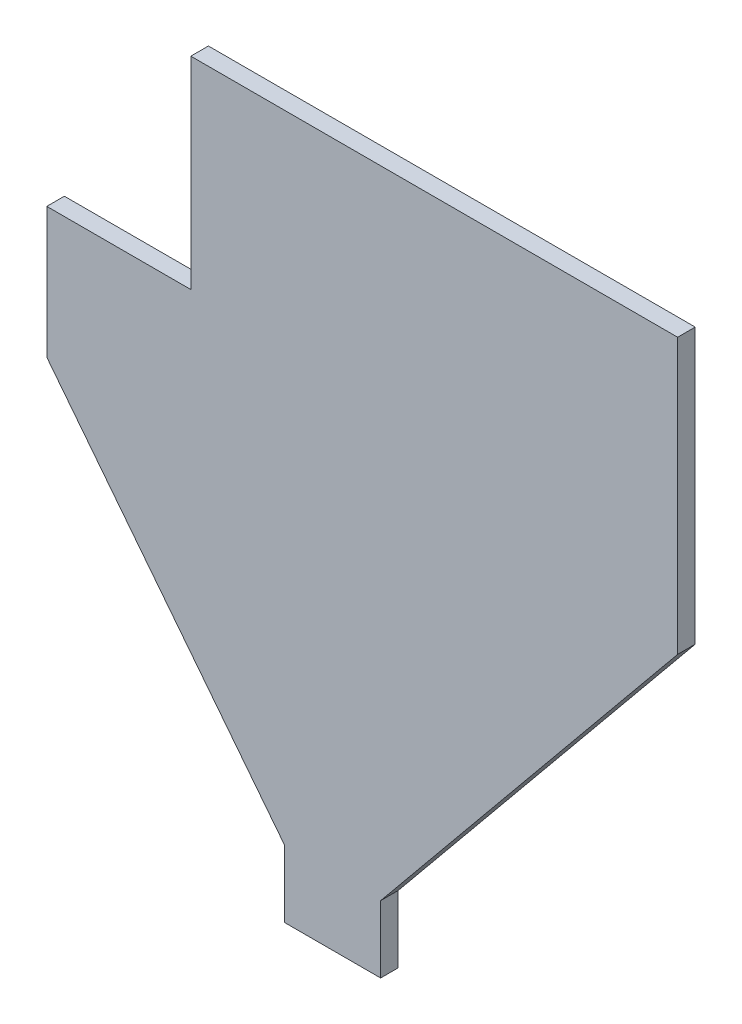
ISO-10303-21;
HEADER;
FILE_DESCRIPTION(('STEP AP214'),'2;1');
FILE_NAME('part.step','',(''),(''),'','','');
FILE_SCHEMA(('AUTOMOTIVE_DESIGN { 1 0 10303 214 1 1 1 1 }'));
ENDSEC;
DATA;
#1=APPLICATION_CONTEXT('core data for automotive mechanical design processes');
#2=APPLICATION_PROTOCOL_DEFINITION('international standard','automotive_design',2000,#1);
#3=PRODUCT_CONTEXT('',#1,'mechanical');
#4=PRODUCT('Part','Part','',(#3));
#5=PRODUCT_RELATED_PRODUCT_CATEGORY('part','',(#4));
#6=PRODUCT_DEFINITION_FORMATION('','',#4);
#7=PRODUCT_DEFINITION_CONTEXT('part definition',#1,'design');
#8=PRODUCT_DEFINITION('design','',#6,#7);
#9=PRODUCT_DEFINITION_SHAPE('','',#8);
#10=(LENGTH_UNIT() NAMED_UNIT(*) SI_UNIT(.MILLI.,.METRE.));
#11=(NAMED_UNIT(*) PLANE_ANGLE_UNIT() SI_UNIT($,.RADIAN.));
#12=(NAMED_UNIT(*) SI_UNIT($,.STERADIAN.) SOLID_ANGLE_UNIT());
#13=UNCERTAINTY_MEASURE_WITH_UNIT(LENGTH_MEASURE(1.E-05),#10,'distance_accuracy_value','');
#14=(GEOMETRIC_REPRESENTATION_CONTEXT(3) GLOBAL_UNCERTAINTY_ASSIGNED_CONTEXT((#13)) GLOBAL_UNIT_ASSIGNED_CONTEXT((#10,
#11,#12)) REPRESENTATION_CONTEXT('',''));
#15=CARTESIAN_POINT('',(0.,0.,0.));
#16=DIRECTION('',(0.,0.,1.));
#17=DIRECTION('',(1.,0.,0.));
#18=AXIS2_PLACEMENT_3D('',#15,#16,#17);
#19=CARTESIAN_POINT('',(39.243,-1.27,2.));
#20=DIRECTION('',(0.,-1.,0.));
#21=DIRECTION('',(1.,0.,0.));
#22=AXIS2_PLACEMENT_3D('',#19,#20,#21);
#23=PLANE('',#22);
#24=DIRECTION('',(-1.,0.,0.));
#25=VECTOR('',#24,1.);
#26=CARTESIAN_POINT('',(39.243,-1.27,0.));
#27=LINE('',#26,#25);
#28=CARTESIAN_POINT('',(39.243,-1.27,0.));
#29=VERTEX_POINT('',#28);
#30=CARTESIAN_POINT('',(-16.129,-1.27,0.));
#31=VERTEX_POINT('',#30);
#32=EDGE_CURVE('E141',#29,#31,#27,.T.);
#33=ORIENTED_EDGE('',*,*,#32,.T.);
#34=DIRECTION('',(0.,0.,-1.));
#35=VECTOR('',#34,1.);
#36=CARTESIAN_POINT('',(-16.129,-1.27,2.));
#37=LINE('',#36,#35);
#38=CARTESIAN_POINT('',(-16.129,-1.27,2.));
#39=VERTEX_POINT('',#38);
#40=EDGE_CURVE('E11',#39,#31,#37,.T.);
#41=ORIENTED_EDGE('',*,*,#40,.F.);
#42=DIRECTION('',(-1.,0.,0.));
#43=VECTOR('',#42,1.);
#44=CARTESIAN_POINT('',(39.243,-1.27,2.));
#45=LINE('',#44,#43);
#46=CARTESIAN_POINT('',(39.243,-1.27,2.));
#47=VERTEX_POINT('',#46);
#48=EDGE_CURVE('E159',#47,#39,#45,.T.);
#49=ORIENTED_EDGE('',*,*,#48,.F.);
#50=DIRECTION('',(0.,0.,-1.));
#51=VECTOR('',#50,1.);
#52=CARTESIAN_POINT('',(39.243,-1.27,2.));
#53=LINE('',#52,#51);
#54=EDGE_CURVE('E137',#47,#29,#53,.T.);
#55=ORIENTED_EDGE('',*,*,#54,.T.);
#56=EDGE_LOOP('',(#33,#41,#49,#55));
#57=FACE_BOUND('',#56,.T.);
#58=ADVANCED_FACE('F33',(#57),#23,.F.);
#59=CARTESIAN_POINT('',(-16.129,-1.27,2.));
#60=DIRECTION('',(1.,0.,0.));
#61=DIRECTION('',(0.,1.,0.));
#62=AXIS2_PLACEMENT_3D('',#59,#60,#61);
#63=PLANE('',#62);
#64=DIRECTION('',(0.,-1.,0.));
#65=VECTOR('',#64,1.);
#66=CARTESIAN_POINT('',(-16.129,-1.27,0.));
#67=LINE('',#66,#65);
#68=CARTESIAN_POINT('',(-16.129,-24.257,0.));
#69=VERTEX_POINT('',#68);
#70=EDGE_CURVE('E144',#31,#69,#67,.T.);
#71=ORIENTED_EDGE('',*,*,#70,.T.);
#72=DIRECTION('',(0.,0.,-1.));
#73=VECTOR('',#72,1.);
#74=CARTESIAN_POINT('',(-16.129,-24.257,2.));
#75=LINE('',#74,#73);
#76=CARTESIAN_POINT('',(-16.129,-24.257,2.));
#77=VERTEX_POINT('',#76);
#78=EDGE_CURVE('E41',#77,#69,#75,.T.);
#79=ORIENTED_EDGE('',*,*,#78,.F.);
#80=DIRECTION('',(0.,-1.,0.));
#81=VECTOR('',#80,1.);
#82=CARTESIAN_POINT('',(-16.129,-1.27,2.));
#83=LINE('',#82,#81);
#84=EDGE_CURVE('E98',#39,#77,#83,.T.);
#85=ORIENTED_EDGE('',*,*,#84,.F.);
#86=ORIENTED_EDGE('',*,*,#40,.T.);
#87=EDGE_LOOP('',(#71,#79,#85,#86));
#88=FACE_BOUND('',#87,.T.);
#89=ADVANCED_FACE('F208',(#88),#63,.F.);
#90=CARTESIAN_POINT('',(-16.129,-24.257,2.));
#91=DIRECTION('',(0.,-1.,0.));
#92=DIRECTION('',(1.,0.,0.));
#93=AXIS2_PLACEMENT_3D('',#90,#91,#92);
#94=PLANE('',#93);
#95=DIRECTION('',(-1.,0.,0.));
#96=VECTOR('',#95,1.);
#97=CARTESIAN_POINT('',(-16.129,-24.257,0.));
#98=LINE('',#97,#96);
#99=CARTESIAN_POINT('',(-32.512,-24.257,0.));
#100=VERTEX_POINT('',#99);
#101=EDGE_CURVE('E146',#69,#100,#98,.T.);
#102=ORIENTED_EDGE('',*,*,#101,.T.);
#103=DIRECTION('',(0.,0.,-1.));
#104=VECTOR('',#103,1.);
#105=CARTESIAN_POINT('',(-32.512,-24.257,2.));
#106=LINE('',#105,#104);
#107=CARTESIAN_POINT('',(-32.512,-24.257,2.));
#108=VERTEX_POINT('',#107);
#109=EDGE_CURVE('E172',#108,#100,#106,.T.);
#110=ORIENTED_EDGE('',*,*,#109,.F.);
#111=DIRECTION('',(-1.,0.,0.));
#112=VECTOR('',#111,1.);
#113=CARTESIAN_POINT('',(-16.129,-24.257,2.));
#114=LINE('',#113,#112);
#115=EDGE_CURVE('E180',#77,#108,#114,.T.);
#116=ORIENTED_EDGE('',*,*,#115,.F.);
#117=ORIENTED_EDGE('',*,*,#78,.T.);
#118=EDGE_LOOP('',(#102,#110,#116,#117));
#119=FACE_BOUND('',#118,.T.);
#120=ADVANCED_FACE('F178',(#119),#94,.F.);
#121=CARTESIAN_POINT('',(-32.512,-24.257,2.));
#122=DIRECTION('',(1.,0.,0.));
#123=DIRECTION('',(0.,1.,0.));
#124=AXIS2_PLACEMENT_3D('',#121,#122,#123);
#125=PLANE('',#124);
#126=DIRECTION('',(0.,-1.,0.));
#127=VECTOR('',#126,1.);
#128=CARTESIAN_POINT('',(-32.512,-24.257,0.));
#129=LINE('',#128,#127);
#130=CARTESIAN_POINT('',(-32.512,-39.116,0.));
#131=VERTEX_POINT('',#130);
#132=EDGE_CURVE('E148',#100,#131,#129,.T.);
#133=ORIENTED_EDGE('',*,*,#132,.T.);
#134=DIRECTION('',(0.,0.,-1.));
#135=VECTOR('',#134,1.);
#136=CARTESIAN_POINT('',(-32.512,-39.116,2.));
#137=LINE('',#136,#135);
#138=CARTESIAN_POINT('',(-32.512,-39.116,2.));
#139=VERTEX_POINT('',#138);
#140=EDGE_CURVE('E169',#139,#131,#137,.T.);
#141=ORIENTED_EDGE('',*,*,#140,.F.);
#142=DIRECTION('',(0.,-1.,0.));
#143=VECTOR('',#142,1.);
#144=CARTESIAN_POINT('',(-32.512,-24.257,2.));
#145=LINE('',#144,#143);
#146=EDGE_CURVE('E198',#108,#139,#145,.T.);
#147=ORIENTED_EDGE('',*,*,#146,.F.);
#148=ORIENTED_EDGE('',*,*,#109,.T.);
#149=EDGE_LOOP('',(#133,#141,#147,#148));
#150=FACE_BOUND('',#149,.T.);
#151=ADVANCED_FACE('F189',(#150),#125,.F.);
#152=CARTESIAN_POINT('',(-32.512,-39.116,2.));
#153=DIRECTION('',(0.787321722918435,0.616542378608922,0.));
#154=DIRECTION('',(-0.616542378608922,0.787321722918435,0.));
#155=AXIS2_PLACEMENT_3D('',#152,#153,#154);
#156=PLANE('',#155);
#157=DIRECTION('',(0.616542378608921,-0.787321722918435,0.));
#158=VECTOR('',#157,1.);
#159=CARTESIAN_POINT('',(-32.512,-39.116,0.));
#160=LINE('',#159,#158);
#161=CARTESIAN_POINT('',(-5.461,-73.66,0.));
#162=VERTEX_POINT('',#161);
#163=EDGE_CURVE('E150',#131,#162,#160,.T.);
#164=ORIENTED_EDGE('',*,*,#163,.T.);
#165=DIRECTION('',(0.,0.,-1.));
#166=VECTOR('',#165,1.);
#167=CARTESIAN_POINT('',(-5.461,-73.66,2.));
#168=LINE('',#167,#166);
#169=CARTESIAN_POINT('',(-5.461,-73.66,2.));
#170=VERTEX_POINT('',#169);
#171=EDGE_CURVE('E166',#170,#162,#168,.T.);
#172=ORIENTED_EDGE('',*,*,#171,.F.);
#173=DIRECTION('',(0.616542378608921,-0.787321722918435,0.));
#174=VECTOR('',#173,1.);
#175=CARTESIAN_POINT('',(-32.512,-39.116,2.));
#176=LINE('',#175,#174);
#177=EDGE_CURVE('E195',#139,#170,#176,.T.);
#178=ORIENTED_EDGE('',*,*,#177,.F.);
#179=ORIENTED_EDGE('',*,*,#140,.T.);
#180=EDGE_LOOP('',(#164,#172,#178,#179));
#181=FACE_BOUND('',#180,.T.);
#182=ADVANCED_FACE('F193',(#181),#156,.F.);
#183=CARTESIAN_POINT('',(-5.461,-73.66,2.));
#184=DIRECTION('',(1.,0.,0.));
#185=DIRECTION('',(0.,1.,0.));
#186=AXIS2_PLACEMENT_3D('',#183,#184,#185);
#187=PLANE('',#186);
#188=DIRECTION('',(0.,-1.,0.));
#189=VECTOR('',#188,1.);
#190=CARTESIAN_POINT('',(-5.461,-73.66,0.));
#191=LINE('',#190,#189);
#192=CARTESIAN_POINT('',(-5.46099999999999,-81.28,0.));
#193=VERTEX_POINT('',#192);
#194=EDGE_CURVE('E152',#162,#193,#191,.T.);
#195=ORIENTED_EDGE('',*,*,#194,.T.);
#196=DIRECTION('',(0.,0.,-1.));
#197=VECTOR('',#196,1.);
#198=CARTESIAN_POINT('',(-5.46099999999999,-81.28,2.));
#199=LINE('',#198,#197);
#200=CARTESIAN_POINT('',(-5.46099999999999,-81.28,2.));
#201=VERTEX_POINT('',#200);
#202=EDGE_CURVE('E163',#201,#193,#199,.T.);
#203=ORIENTED_EDGE('',*,*,#202,.F.);
#204=DIRECTION('',(0.,-1.,0.));
#205=VECTOR('',#204,1.);
#206=CARTESIAN_POINT('',(-5.461,-73.66,2.));
#207=LINE('',#206,#205);
#208=EDGE_CURVE('E197',#170,#201,#207,.T.);
#209=ORIENTED_EDGE('',*,*,#208,.F.);
#210=ORIENTED_EDGE('',*,*,#171,.T.);
#211=EDGE_LOOP('',(#195,#203,#209,#210));
#212=FACE_BOUND('',#211,.T.);
#213=ADVANCED_FACE('F220',(#212),#187,.F.);
#214=CARTESIAN_POINT('',(-5.46099999999999,-81.28,2.));
#215=DIRECTION('',(0.,1.,0.));
#216=DIRECTION('',(0.,0.,1.));
#217=AXIS2_PLACEMENT_3D('',#214,#215,#216);
#218=PLANE('',#217);
#219=DIRECTION('',(1.,0.,0.));
#220=VECTOR('',#219,1.);
#221=CARTESIAN_POINT('',(-5.46099999999999,-81.28,0.));
#222=LINE('',#221,#220);
#223=CARTESIAN_POINT('',(5.46100000000001,-81.28,0.));
#224=VERTEX_POINT('',#223);
#225=EDGE_CURVE('E154',#193,#224,#222,.T.);
#226=ORIENTED_EDGE('',*,*,#225,.T.);
#227=DIRECTION('',(0.,0.,-1.));
#228=VECTOR('',#227,1.);
#229=CARTESIAN_POINT('',(5.46100000000001,-81.28,2.));
#230=LINE('',#229,#228);
#231=CARTESIAN_POINT('',(5.46100000000001,-81.28,2.));
#232=VERTEX_POINT('',#231);
#233=EDGE_CURVE('E132',#232,#224,#230,.T.);
#234=ORIENTED_EDGE('',*,*,#233,.F.);
#235=DIRECTION('',(1.,0.,0.));
#236=VECTOR('',#235,1.);
#237=CARTESIAN_POINT('',(-5.46099999999999,-81.28,2.));
#238=LINE('',#237,#236);
#239=EDGE_CURVE('E123',#201,#232,#238,.T.);
#240=ORIENTED_EDGE('',*,*,#239,.F.);
#241=ORIENTED_EDGE('',*,*,#202,.T.);
#242=EDGE_LOOP('',(#226,#234,#240,#241));
#243=FACE_BOUND('',#242,.T.);
#244=ADVANCED_FACE('F223',(#243),#218,.F.);
#245=CARTESIAN_POINT('',(5.46100000000001,-81.28,2.));
#246=DIRECTION('',(-1.,0.,0.));
#247=DIRECTION('',(0.,-1.,0.));
#248=AXIS2_PLACEMENT_3D('',#245,#246,#247);
#249=PLANE('',#248);
#250=DIRECTION('',(0.,1.,0.));
#251=VECTOR('',#250,1.);
#252=CARTESIAN_POINT('',(5.46100000000001,-81.28,0.));
#253=LINE('',#252,#251);
#254=CARTESIAN_POINT('',(5.461,-73.66,0.));
#255=VERTEX_POINT('',#254);
#256=EDGE_CURVE('E131',#224,#255,#253,.T.);
#257=ORIENTED_EDGE('',*,*,#256,.T.);
#258=DIRECTION('',(0.,0.,-1.));
#259=VECTOR('',#258,1.);
#260=CARTESIAN_POINT('',(5.461,-73.66,2.));
#261=LINE('',#260,#259);
#262=CARTESIAN_POINT('',(5.461,-73.66,2.));
#263=VERTEX_POINT('',#262);
#264=EDGE_CURVE('E128',#263,#255,#261,.T.);
#265=ORIENTED_EDGE('',*,*,#264,.F.);
#266=DIRECTION('',(0.,1.,0.));
#267=VECTOR('',#266,1.);
#268=CARTESIAN_POINT('',(5.46100000000001,-81.28,2.));
#269=LINE('',#268,#267);
#270=EDGE_CURVE('E117',#232,#263,#269,.T.);
#271=ORIENTED_EDGE('',*,*,#270,.F.);
#272=ORIENTED_EDGE('',*,*,#233,.T.);
#273=EDGE_LOOP('',(#257,#265,#271,#272));
#274=FACE_BOUND('',#273,.T.);
#275=ADVANCED_FACE('F129',(#274),#249,.F.);
#276=CARTESIAN_POINT('',(5.461,-73.66,2.));
#277=DIRECTION('',(-0.772893374383013,0.634535918474943,0.));
#278=DIRECTION('',(-0.634535918474943,-0.772893374383013,0.));
#279=AXIS2_PLACEMENT_3D('',#276,#277,#278);
#280=PLANE('',#279);
#281=DIRECTION('',(0.634535918474943,0.772893374383013,0.));
#282=VECTOR('',#281,1.);
#283=CARTESIAN_POINT('',(5.461,-73.66,0.));
#284=LINE('',#283,#282);
#285=CARTESIAN_POINT('',(39.243,-32.512,0.));
#286=VERTEX_POINT('',#285);
#287=EDGE_CURVE('E84',#255,#286,#284,.T.);
#288=ORIENTED_EDGE('',*,*,#287,.T.);
#289=DIRECTION('',(0.,0.,-1.));
#290=VECTOR('',#289,1.);
#291=CARTESIAN_POINT('',(39.243,-32.512,2.));
#292=LINE('',#291,#290);
#293=CARTESIAN_POINT('',(39.243,-32.512,2.));
#294=VERTEX_POINT('',#293);
#295=EDGE_CURVE('E133',#294,#286,#292,.T.);
#296=ORIENTED_EDGE('',*,*,#295,.F.);
#297=DIRECTION('',(0.634535918474943,0.772893374383013,0.));
#298=VECTOR('',#297,1.);
#299=CARTESIAN_POINT('',(5.461,-73.66,2.));
#300=LINE('',#299,#298);
#301=EDGE_CURVE('E121',#263,#294,#300,.T.);
#302=ORIENTED_EDGE('',*,*,#301,.F.);
#303=ORIENTED_EDGE('',*,*,#264,.T.);
#304=EDGE_LOOP('',(#288,#296,#302,#303));
#305=FACE_BOUND('',#304,.T.);
#306=ADVANCED_FACE('F135',(#305),#280,.F.);
#307=CARTESIAN_POINT('',(39.243,-32.512,2.));
#308=DIRECTION('',(-1.,0.,0.));
#309=DIRECTION('',(0.,0.,1.));
#310=AXIS2_PLACEMENT_3D('',#307,#308,#309);
#311=PLANE('',#310);
#312=DIRECTION('',(0.,1.,0.));
#313=VECTOR('',#312,1.);
#314=CARTESIAN_POINT('',(39.243,-32.512,0.));
#315=LINE('',#314,#313);
#316=EDGE_CURVE('E90',#286,#29,#315,.T.);
#317=ORIENTED_EDGE('',*,*,#316,.T.);
#318=ORIENTED_EDGE('',*,*,#54,.F.);
#319=DIRECTION('',(0.,1.,0.));
#320=VECTOR('',#319,1.);
#321=CARTESIAN_POINT('',(39.243,-32.512,2.));
#322=LINE('',#321,#320);
#323=EDGE_CURVE('E49',#294,#47,#322,.T.);
#324=ORIENTED_EDGE('',*,*,#323,.F.);
#325=ORIENTED_EDGE('',*,*,#295,.T.);
#326=EDGE_LOOP('',(#317,#318,#324,#325));
#327=FACE_BOUND('',#326,.T.);
#328=ADVANCED_FACE('F232',(#327),#311,.F.);
#329=CARTESIAN_POINT('',(0.,0.,2.));
#330=DIRECTION('',(0.,0.,1.));
#331=DIRECTION('',(1.,0.,0.));
#332=AXIS2_PLACEMENT_3D('',#329,#330,#331);
#333=PLANE('',#332);
#334=ORIENTED_EDGE('',*,*,#48,.T.);
#335=ORIENTED_EDGE('',*,*,#84,.T.);
#336=ORIENTED_EDGE('',*,*,#115,.T.);
#337=ORIENTED_EDGE('',*,*,#146,.T.);
#338=ORIENTED_EDGE('',*,*,#177,.T.);
#339=ORIENTED_EDGE('',*,*,#208,.T.);
#340=ORIENTED_EDGE('',*,*,#239,.T.);
#341=ORIENTED_EDGE('',*,*,#270,.T.);
#342=ORIENTED_EDGE('',*,*,#301,.T.);
#343=ORIENTED_EDGE('',*,*,#323,.T.);
#344=EDGE_LOOP('',(#334,#335,#336,#337,#338,#339,#340,#341,#342,#343));
#345=FACE_BOUND('',#344,.T.);
#346=ADVANCED_FACE('F119',(#345),#333,.T.);
#347=CARTESIAN_POINT('',(0.,0.,0.));
#348=DIRECTION('',(0.,0.,1.));
#349=DIRECTION('',(1.,0.,0.));
#350=AXIS2_PLACEMENT_3D('',#347,#348,#349);
#351=PLANE('',#350);
#352=ORIENTED_EDGE('',*,*,#32,.F.);
#353=ORIENTED_EDGE('',*,*,#316,.F.);
#354=ORIENTED_EDGE('',*,*,#287,.F.);
#355=ORIENTED_EDGE('',*,*,#256,.F.);
#356=ORIENTED_EDGE('',*,*,#225,.F.);
#357=ORIENTED_EDGE('',*,*,#194,.F.);
#358=ORIENTED_EDGE('',*,*,#163,.F.);
#359=ORIENTED_EDGE('',*,*,#132,.F.);
#360=ORIENTED_EDGE('',*,*,#101,.F.);
#361=ORIENTED_EDGE('',*,*,#70,.F.);
#362=EDGE_LOOP('',(#352,#353,#354,#355,#356,#357,#358,#359,#360,#361));
#363=FACE_BOUND('',#362,.T.);
#364=ADVANCED_FACE('F184',(#363),#351,.F.);
#365=CLOSED_SHELL('',(#58,#89,#120,#151,#182,#213,#244,#275,#306,#328,#346,#364));
#366=MANIFOLD_SOLID_BREP('B2',#365);
#367=ADVANCED_BREP_SHAPE_REPRESENTATION('',(#18,#366),#14);
#368=SHAPE_DEFINITION_REPRESENTATION(#9,#367);
ENDSEC;
END-ISO-10303-21;
